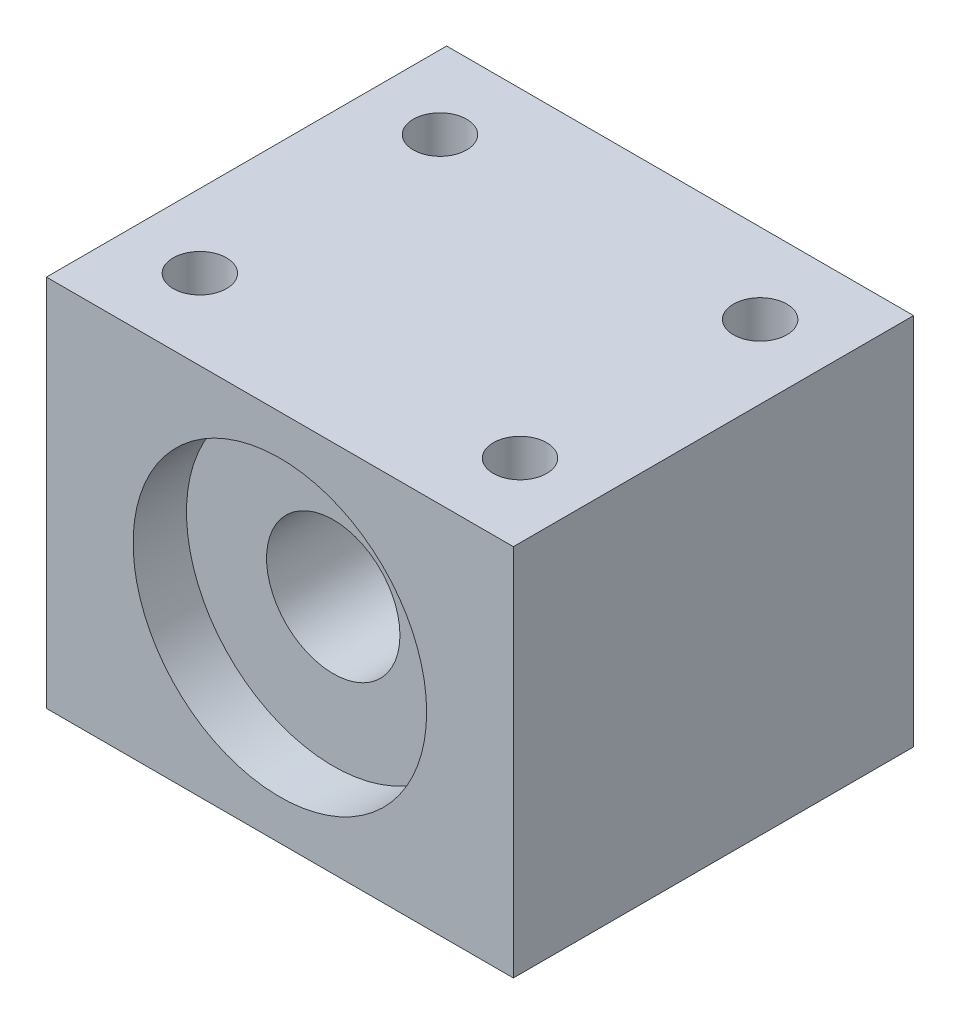
ISO-10303-21;
HEADER;
FILE_DESCRIPTION(('STEP AP214'),'2;1');
FILE_NAME('part.step','',(''),(''),'','','');
FILE_SCHEMA(('AUTOMOTIVE_DESIGN { 1 0 10303 214 1 1 1 1 }'));
ENDSEC;
DATA;
#1=APPLICATION_CONTEXT('core data for automotive mechanical design processes');
#2=APPLICATION_PROTOCOL_DEFINITION('international standard','automotive_design',2000,#1);
#3=PRODUCT_CONTEXT('',#1,'mechanical');
#4=PRODUCT('Part','Part','',(#3));
#5=PRODUCT_RELATED_PRODUCT_CATEGORY('part','',(#4));
#6=PRODUCT_DEFINITION_FORMATION('','',#4);
#7=PRODUCT_DEFINITION_CONTEXT('part definition',#1,'design');
#8=PRODUCT_DEFINITION('design','',#6,#7);
#9=PRODUCT_DEFINITION_SHAPE('','',#8);
#10=(LENGTH_UNIT() NAMED_UNIT(*) SI_UNIT(.MILLI.,.METRE.));
#11=(NAMED_UNIT(*) PLANE_ANGLE_UNIT() SI_UNIT($,.RADIAN.));
#12=(NAMED_UNIT(*) SI_UNIT($,.STERADIAN.) SOLID_ANGLE_UNIT());
#13=UNCERTAINTY_MEASURE_WITH_UNIT(LENGTH_MEASURE(1.E-05),#10,'distance_accuracy_value','');
#14=(GEOMETRIC_REPRESENTATION_CONTEXT(3) GLOBAL_UNCERTAINTY_ASSIGNED_CONTEXT((#13)) GLOBAL_UNIT_ASSIGNED_CONTEXT((#10,
#11,#12)) REPRESENTATION_CONTEXT('',''));
#15=CARTESIAN_POINT('',(0.,0.,0.));
#16=DIRECTION('',(0.,0.,1.));
#17=DIRECTION('',(1.,0.,0.));
#18=AXIS2_PLACEMENT_3D('',#15,#16,#17);
#19=CARTESIAN_POINT('',(0.,28.,0.));
#20=DIRECTION('',(0.,-1.,0.));
#21=DIRECTION('',(0.,0.,-1.));
#22=AXIS2_PLACEMENT_3D('',#19,#20,#21);
#23=PLANE('',#22);
#24=DIRECTION('',(0.,0.,-1.));
#25=VECTOR('',#24,1.);
#26=CARTESIAN_POINT('',(17.5,28.,15.));
#27=LINE('',#26,#25);
#28=CARTESIAN_POINT('',(17.5,28.,15.));
#29=VERTEX_POINT('',#28);
#30=CARTESIAN_POINT('',(17.5,28.,-15.));
#31=VERTEX_POINT('',#30);
#32=EDGE_CURVE('E92',#29,#31,#27,.T.);
#33=ORIENTED_EDGE('',*,*,#32,.T.);
#34=DIRECTION('',(-1.,0.,0.));
#35=VECTOR('',#34,1.);
#36=CARTESIAN_POINT('',(-17.5,28.,-15.));
#37=LINE('',#36,#35);
#38=CARTESIAN_POINT('',(-17.5,28.,-15.));
#39=VERTEX_POINT('',#38);
#40=EDGE_CURVE('E87',#31,#39,#37,.T.);
#41=ORIENTED_EDGE('',*,*,#40,.T.);
#42=DIRECTION('',(0.,0.,1.));
#43=VECTOR('',#42,1.);
#44=CARTESIAN_POINT('',(-17.5,28.,15.));
#45=LINE('',#44,#43);
#46=CARTESIAN_POINT('',(-17.5,28.,15.));
#47=VERTEX_POINT('',#46);
#48=EDGE_CURVE('E90',#39,#47,#45,.T.);
#49=ORIENTED_EDGE('',*,*,#48,.T.);
#50=DIRECTION('',(1.,0.,0.));
#51=VECTOR('',#50,1.);
#52=CARTESIAN_POINT('',(-17.5,28.,15.));
#53=LINE('',#52,#51);
#54=EDGE_CURVE('E57',#47,#29,#53,.T.);
#55=ORIENTED_EDGE('',*,*,#54,.T.);
#56=EDGE_LOOP('',(#33,#41,#49,#55));
#57=FACE_BOUND('',#56,.T.);
#58=CARTESIAN_POINT('',(-12.,28.,-9.00000000000001));
#59=DIRECTION('',(0.,1.,0.));
#60=DIRECTION('',(0.,0.,1.));
#61=AXIS2_PLACEMENT_3D('',#58,#59,#60);
#62=CIRCLE('',#61,2.);
#63=CARTESIAN_POINT('',(-12.,28.,-7.00000000000001));
#64=VERTEX_POINT('',#63);
#65=EDGE_CURVE('E112',#64,#64,#62,.T.);
#66=ORIENTED_EDGE('',*,*,#65,.F.);
#67=EDGE_LOOP('',(#66));
#68=FACE_BOUND('',#67,.T.);
#69=CARTESIAN_POINT('',(-12.,28.,8.99999999999999));
#70=DIRECTION('',(0.,1.,0.));
#71=DIRECTION('',(0.,0.,-1.));
#72=AXIS2_PLACEMENT_3D('',#69,#70,#71);
#73=CIRCLE('',#72,2.);
#74=CARTESIAN_POINT('',(-12.,28.,7.));
#75=VERTEX_POINT('',#74);
#76=EDGE_CURVE('E134',#75,#75,#73,.T.);
#77=ORIENTED_EDGE('',*,*,#76,.F.);
#78=EDGE_LOOP('',(#77));
#79=FACE_BOUND('',#78,.T.);
#80=CARTESIAN_POINT('',(12.,28.,8.99999999999998));
#81=DIRECTION('',(0.,1.,0.));
#82=DIRECTION('',(0.,0.,1.));
#83=AXIS2_PLACEMENT_3D('',#80,#81,#82);
#84=CIRCLE('',#83,2.);
#85=CARTESIAN_POINT('',(12.,28.,11.));
#86=VERTEX_POINT('',#85);
#87=EDGE_CURVE('E142',#86,#86,#84,.T.);
#88=ORIENTED_EDGE('',*,*,#87,.F.);
#89=EDGE_LOOP('',(#88));
#90=FACE_BOUND('',#89,.T.);
#91=CARTESIAN_POINT('',(12.,28.,-9.00000000000001));
#92=DIRECTION('',(0.,1.,0.));
#93=DIRECTION('',(0.,0.,-1.));
#94=AXIS2_PLACEMENT_3D('',#91,#92,#93);
#95=CIRCLE('',#94,1.99999999999999);
#96=CARTESIAN_POINT('',(12.,28.,-11.));
#97=VERTEX_POINT('',#96);
#98=EDGE_CURVE('E150',#97,#97,#95,.T.);
#99=ORIENTED_EDGE('',*,*,#98,.F.);
#100=EDGE_LOOP('',(#99));
#101=FACE_BOUND('',#100,.T.);
#102=ADVANCED_FACE('F39',(#57,#68,#79,#90,#101),#23,.F.);
#103=CARTESIAN_POINT('',(0.,0.,0.));
#104=DIRECTION('',(0.,-1.,0.));
#105=DIRECTION('',(0.,0.,-1.));
#106=AXIS2_PLACEMENT_3D('',#103,#104,#105);
#107=PLANE('',#106);
#108=CARTESIAN_POINT('',(12.,0.,8.99999999999998));
#109=DIRECTION('',(0.,1.,0.));
#110=DIRECTION('',(0.,0.,1.));
#111=AXIS2_PLACEMENT_3D('',#108,#109,#110);
#112=CIRCLE('',#111,2.);
#113=CARTESIAN_POINT('',(12.,0.,11.));
#114=VERTEX_POINT('',#113);
#115=EDGE_CURVE('E146',#114,#114,#112,.T.);
#116=ORIENTED_EDGE('',*,*,#115,.T.);
#117=EDGE_LOOP('',(#116));
#118=FACE_BOUND('',#117,.T.);
#119=CARTESIAN_POINT('',(-12.,0.,-9.00000000000001));
#120=DIRECTION('',(0.,1.,0.));
#121=DIRECTION('',(0.,0.,1.));
#122=AXIS2_PLACEMENT_3D('',#119,#120,#121);
#123=CIRCLE('',#122,2.);
#124=CARTESIAN_POINT('',(-12.,0.,-7.00000000000001));
#125=VERTEX_POINT('',#124);
#126=EDGE_CURVE('E130',#125,#125,#123,.T.);
#127=ORIENTED_EDGE('',*,*,#126,.T.);
#128=EDGE_LOOP('',(#127));
#129=FACE_BOUND('',#128,.T.);
#130=DIRECTION('',(0.,0.,-1.));
#131=VECTOR('',#130,1.);
#132=CARTESIAN_POINT('',(17.5,0.,15.));
#133=LINE('',#132,#131);
#134=CARTESIAN_POINT('',(17.5,0.,15.));
#135=VERTEX_POINT('',#134);
#136=CARTESIAN_POINT('',(17.5,0.,-15.));
#137=VERTEX_POINT('',#136);
#138=EDGE_CURVE('E108',#135,#137,#133,.T.);
#139=ORIENTED_EDGE('',*,*,#138,.F.);
#140=DIRECTION('',(1.,0.,0.));
#141=VECTOR('',#140,1.);
#142=CARTESIAN_POINT('',(-17.5,0.,15.));
#143=LINE('',#142,#141);
#144=CARTESIAN_POINT('',(-17.5,0.,15.));
#145=VERTEX_POINT('',#144);
#146=EDGE_CURVE('E80',#145,#135,#143,.T.);
#147=ORIENTED_EDGE('',*,*,#146,.F.);
#148=DIRECTION('',(0.,0.,1.));
#149=VECTOR('',#148,1.);
#150=CARTESIAN_POINT('',(-17.5,0.,15.));
#151=LINE('',#150,#149);
#152=CARTESIAN_POINT('',(-17.5,0.,-15.));
#153=VERTEX_POINT('',#152);
#154=EDGE_CURVE('E74',#153,#145,#151,.T.);
#155=ORIENTED_EDGE('',*,*,#154,.F.);
#156=DIRECTION('',(-1.,0.,0.));
#157=VECTOR('',#156,1.);
#158=CARTESIAN_POINT('',(-17.5,0.,-15.));
#159=LINE('',#158,#157);
#160=EDGE_CURVE('E97',#137,#153,#159,.T.);
#161=ORIENTED_EDGE('',*,*,#160,.F.);
#162=EDGE_LOOP('',(#139,#147,#155,#161));
#163=FACE_BOUND('',#162,.T.);
#164=CARTESIAN_POINT('',(-12.,0.,8.99999999999999));
#165=DIRECTION('',(0.,1.,0.));
#166=DIRECTION('',(0.,0.,-1.));
#167=AXIS2_PLACEMENT_3D('',#164,#165,#166);
#168=CIRCLE('',#167,2.);
#169=CARTESIAN_POINT('',(-12.,0.,7.));
#170=VERTEX_POINT('',#169);
#171=EDGE_CURVE('E138',#170,#170,#168,.T.);
#172=ORIENTED_EDGE('',*,*,#171,.T.);
#173=EDGE_LOOP('',(#172));
#174=FACE_BOUND('',#173,.T.);
#175=CARTESIAN_POINT('',(12.,0.,-9.00000000000001));
#176=DIRECTION('',(0.,1.,0.));
#177=DIRECTION('',(0.,0.,-1.));
#178=AXIS2_PLACEMENT_3D('',#175,#176,#177);
#179=CIRCLE('',#178,1.99999999999999);
#180=CARTESIAN_POINT('',(12.,0.,-11.));
#181=VERTEX_POINT('',#180);
#182=EDGE_CURVE('E154',#181,#181,#179,.T.);
#183=ORIENTED_EDGE('',*,*,#182,.T.);
#184=EDGE_LOOP('',(#183));
#185=FACE_BOUND('',#184,.T.);
#186=ADVANCED_FACE('F125',(#118,#129,#163,#174,#185),#107,.T.);
#187=CARTESIAN_POINT('',(17.5,28.,15.));
#188=DIRECTION('',(-1.,0.,0.));
#189=DIRECTION('',(0.,0.,1.));
#190=AXIS2_PLACEMENT_3D('',#187,#188,#189);
#191=PLANE('',#190);
#192=ORIENTED_EDGE('',*,*,#138,.T.);
#193=DIRECTION('',(0.,-1.,0.));
#194=VECTOR('',#193,1.);
#195=CARTESIAN_POINT('',(17.5,28.,-15.));
#196=LINE('',#195,#194);
#197=EDGE_CURVE('E11',#31,#137,#196,.T.);
#198=ORIENTED_EDGE('',*,*,#197,.F.);
#199=ORIENTED_EDGE('',*,*,#32,.F.);
#200=DIRECTION('',(0.,-1.,0.));
#201=VECTOR('',#200,1.);
#202=CARTESIAN_POINT('',(17.5,28.,15.));
#203=LINE('',#202,#201);
#204=EDGE_CURVE('E104',#29,#135,#203,.T.);
#205=ORIENTED_EDGE('',*,*,#204,.T.);
#206=EDGE_LOOP('',(#192,#198,#199,#205));
#207=FACE_BOUND('',#206,.T.);
#208=ADVANCED_FACE('F41',(#207),#191,.F.);
#209=CARTESIAN_POINT('',(-17.5,28.,-15.));
#210=DIRECTION('',(0.,0.,1.));
#211=DIRECTION('',(1.,0.,0.));
#212=AXIS2_PLACEMENT_3D('',#209,#210,#211);
#213=PLANE('',#212);
#214=CARTESIAN_POINT('',(0.,14.,-15.));
#215=DIRECTION('',(0.,0.,1.));
#216=DIRECTION('',(1.,0.,0.));
#217=AXIS2_PLACEMENT_3D('',#214,#215,#216);
#218=CIRCLE('',#217,5.);
#219=CARTESIAN_POINT('',(5.00000000000002,14.,-15.));
#220=VERTEX_POINT('',#219);
#221=EDGE_CURVE('E166',#220,#220,#218,.T.);
#222=ORIENTED_EDGE('',*,*,#221,.T.);
#223=EDGE_LOOP('',(#222));
#224=FACE_BOUND('',#223,.T.);
#225=ORIENTED_EDGE('',*,*,#160,.T.);
#226=DIRECTION('',(0.,-1.,0.));
#227=VECTOR('',#226,1.);
#228=CARTESIAN_POINT('',(-17.5,28.,-15.));
#229=LINE('',#228,#227);
#230=EDGE_CURVE('E49',#39,#153,#229,.T.);
#231=ORIENTED_EDGE('',*,*,#230,.F.);
#232=ORIENTED_EDGE('',*,*,#40,.F.);
#233=ORIENTED_EDGE('',*,*,#197,.T.);
#234=EDGE_LOOP('',(#225,#231,#232,#233));
#235=FACE_BOUND('',#234,.T.);
#236=ADVANCED_FACE('F96',(#224,#235),#213,.F.);
#237=CARTESIAN_POINT('',(-17.5,28.,15.));
#238=DIRECTION('',(1.,0.,0.));
#239=DIRECTION('',(0.,0.,-1.));
#240=AXIS2_PLACEMENT_3D('',#237,#238,#239);
#241=PLANE('',#240);
#242=ORIENTED_EDGE('',*,*,#154,.T.);
#243=DIRECTION('',(0.,-1.,0.));
#244=VECTOR('',#243,1.);
#245=CARTESIAN_POINT('',(-17.5,28.,15.));
#246=LINE('',#245,#244);
#247=EDGE_CURVE('E99',#47,#145,#246,.T.);
#248=ORIENTED_EDGE('',*,*,#247,.F.);
#249=ORIENTED_EDGE('',*,*,#48,.F.);
#250=ORIENTED_EDGE('',*,*,#230,.T.);
#251=EDGE_LOOP('',(#242,#248,#249,#250));
#252=FACE_BOUND('',#251,.T.);
#253=ADVANCED_FACE('F100',(#252),#241,.F.);
#254=CARTESIAN_POINT('',(-17.5,28.,15.));
#255=DIRECTION('',(0.,0.,-1.));
#256=DIRECTION('',(-1.,0.,0.));
#257=AXIS2_PLACEMENT_3D('',#254,#255,#256);
#258=PLANE('',#257);
#259=CARTESIAN_POINT('',(0.,14.,15.));
#260=DIRECTION('',(0.,0.,1.));
#261=DIRECTION('',(1.,0.,0.));
#262=AXIS2_PLACEMENT_3D('',#259,#260,#261);
#263=CIRCLE('',#262,11.);
#264=CARTESIAN_POINT('',(11.,14.,15.));
#265=VERTEX_POINT('',#264);
#266=EDGE_CURVE('E162',#265,#265,#263,.T.);
#267=ORIENTED_EDGE('',*,*,#266,.F.);
#268=EDGE_LOOP('',(#267));
#269=FACE_BOUND('',#268,.T.);
#270=ORIENTED_EDGE('',*,*,#146,.T.);
#271=ORIENTED_EDGE('',*,*,#204,.F.);
#272=ORIENTED_EDGE('',*,*,#54,.F.);
#273=ORIENTED_EDGE('',*,*,#247,.T.);
#274=EDGE_LOOP('',(#270,#271,#272,#273));
#275=FACE_BOUND('',#274,.T.);
#276=ADVANCED_FACE('F122',(#269,#275),#258,.F.);
#277=CARTESIAN_POINT('',(-12.,28.,-9.00000000000001));
#278=DIRECTION('',(0.,-1.,0.));
#279=DIRECTION('',(0.,0.,-1.));
#280=AXIS2_PLACEMENT_3D('',#277,#278,#279);
#281=CYLINDRICAL_SURFACE('',#280,2.);
#282=ORIENTED_EDGE('',*,*,#65,.T.);
#283=EDGE_LOOP('',(#282));
#284=FACE_BOUND('',#283,.T.);
#285=ORIENTED_EDGE('',*,*,#126,.F.);
#286=EDGE_LOOP('',(#285));
#287=FACE_BOUND('',#286,.T.);
#288=ADVANCED_FACE('F199',(#284,#287),#281,.F.);
#289=CARTESIAN_POINT('',(-12.,28.,8.99999999999999));
#290=DIRECTION('',(0.,-1.,0.));
#291=DIRECTION('',(0.,0.,-1.));
#292=AXIS2_PLACEMENT_3D('',#289,#290,#291);
#293=CYLINDRICAL_SURFACE('',#292,2.);
#294=ORIENTED_EDGE('',*,*,#76,.T.);
#295=EDGE_LOOP('',(#294));
#296=FACE_BOUND('',#295,.T.);
#297=ORIENTED_EDGE('',*,*,#171,.F.);
#298=EDGE_LOOP('',(#297));
#299=FACE_BOUND('',#298,.T.);
#300=ADVANCED_FACE('F205',(#296,#299),#293,.F.);
#301=CARTESIAN_POINT('',(12.,28.,8.99999999999998));
#302=DIRECTION('',(0.,-1.,0.));
#303=DIRECTION('',(0.,0.,-1.));
#304=AXIS2_PLACEMENT_3D('',#301,#302,#303);
#305=CYLINDRICAL_SURFACE('',#304,2.);
#306=ORIENTED_EDGE('',*,*,#87,.T.);
#307=EDGE_LOOP('',(#306));
#308=FACE_BOUND('',#307,.T.);
#309=ORIENTED_EDGE('',*,*,#115,.F.);
#310=EDGE_LOOP('',(#309));
#311=FACE_BOUND('',#310,.T.);
#312=ADVANCED_FACE('F219',(#308,#311),#305,.F.);
#313=CARTESIAN_POINT('',(12.,28.,-9.00000000000001));
#314=DIRECTION('',(0.,-1.,0.));
#315=DIRECTION('',(0.,0.,-1.));
#316=AXIS2_PLACEMENT_3D('',#313,#314,#315);
#317=CYLINDRICAL_SURFACE('',#316,1.99999999999999);
#318=ORIENTED_EDGE('',*,*,#98,.T.);
#319=EDGE_LOOP('',(#318));
#320=FACE_BOUND('',#319,.T.);
#321=ORIENTED_EDGE('',*,*,#182,.F.);
#322=EDGE_LOOP('',(#321));
#323=FACE_BOUND('',#322,.T.);
#324=ADVANCED_FACE('F194',(#320,#323),#317,.F.);
#325=CARTESIAN_POINT('',(0.,14.,11.));
#326=DIRECTION('',(0.,0.,1.));
#327=DIRECTION('',(1.,0.,0.));
#328=AXIS2_PLACEMENT_3D('',#325,#326,#327);
#329=CYLINDRICAL_SURFACE('',#328,11.);
#330=CARTESIAN_POINT('',(0.,14.,11.));
#331=DIRECTION('',(0.,0.,1.));
#332=DIRECTION('',(1.,0.,0.));
#333=AXIS2_PLACEMENT_3D('',#330,#331,#332);
#334=CIRCLE('',#333,11.);
#335=CARTESIAN_POINT('',(11.,14.,11.));
#336=VERTEX_POINT('',#335);
#337=EDGE_CURVE('E158',#336,#336,#334,.T.);
#338=ORIENTED_EDGE('',*,*,#337,.F.);
#339=EDGE_LOOP('',(#338));
#340=FACE_BOUND('',#339,.T.);
#341=ORIENTED_EDGE('',*,*,#266,.T.);
#342=EDGE_LOOP('',(#341));
#343=FACE_BOUND('',#342,.T.);
#344=ADVANCED_FACE('F188',(#340,#343),#329,.F.);
#345=CARTESIAN_POINT('',(0.,14.,11.));
#346=DIRECTION('',(0.,0.,1.));
#347=DIRECTION('',(1.,0.,0.));
#348=AXIS2_PLACEMENT_3D('',#345,#346,#347);
#349=PLANE('',#348);
#350=CARTESIAN_POINT('',(0.,14.,11.));
#351=DIRECTION('',(0.,0.,1.));
#352=DIRECTION('',(1.,0.,0.));
#353=AXIS2_PLACEMENT_3D('',#350,#351,#352);
#354=CIRCLE('',#353,5.);
#355=CARTESIAN_POINT('',(5.00000000000002,14.,11.));
#356=VERTEX_POINT('',#355);
#357=EDGE_CURVE('E170',#356,#356,#354,.T.);
#358=ORIENTED_EDGE('',*,*,#357,.F.);
#359=EDGE_LOOP('',(#358));
#360=FACE_BOUND('',#359,.T.);
#361=ORIENTED_EDGE('',*,*,#337,.T.);
#362=EDGE_LOOP('',(#361));
#363=FACE_BOUND('',#362,.T.);
#364=ADVANCED_FACE('F182',(#360,#363),#349,.T.);
#365=CARTESIAN_POINT('',(0.,14.,-15.));
#366=DIRECTION('',(0.,0.,1.));
#367=DIRECTION('',(1.,0.,0.));
#368=AXIS2_PLACEMENT_3D('',#365,#366,#367);
#369=CYLINDRICAL_SURFACE('',#368,5.);
#370=ORIENTED_EDGE('',*,*,#221,.F.);
#371=EDGE_LOOP('',(#370));
#372=FACE_BOUND('',#371,.T.);
#373=ORIENTED_EDGE('',*,*,#357,.T.);
#374=EDGE_LOOP('',(#373));
#375=FACE_BOUND('',#374,.T.);
#376=ADVANCED_FACE('F179',(#372,#375),#369,.F.);
#377=CLOSED_SHELL('',(#102,#186,#208,#236,#253,#276,#288,#300,#312,#324,#344,#364,#376));
#378=MANIFOLD_SOLID_BREP('B2',#377);
#379=ADVANCED_BREP_SHAPE_REPRESENTATION('',(#18,#378),#14);
#380=SHAPE_DEFINITION_REPRESENTATION(#9,#379);
ENDSEC;
END-ISO-10303-21;
